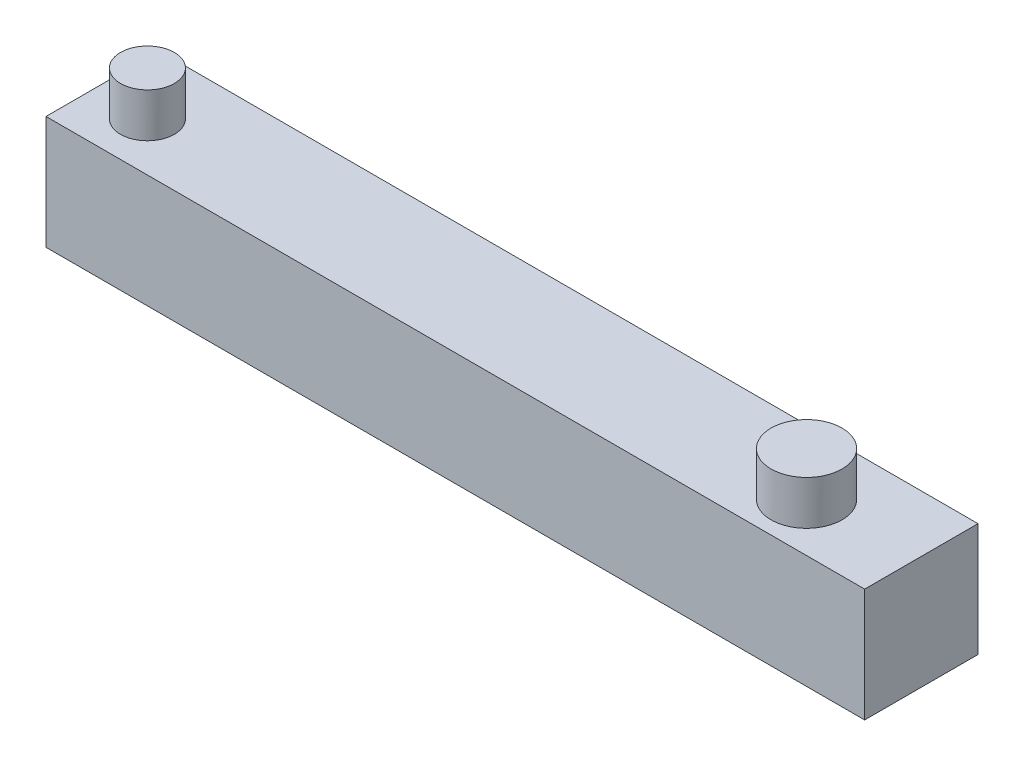
ISO-10303-21;
HEADER;
FILE_DESCRIPTION(('STEP AP214'),'2;1');
FILE_NAME('part.step','',(''),(''),'','','');
FILE_SCHEMA(('AUTOMOTIVE_DESIGN { 1 0 10303 214 1 1 1 1 }'));
ENDSEC;
DATA;
#1=APPLICATION_CONTEXT('core data for automotive mechanical design processes');
#2=APPLICATION_PROTOCOL_DEFINITION('international standard','automotive_design',2000,#1);
#3=PRODUCT_CONTEXT('',#1,'mechanical');
#4=PRODUCT('Part','Part','',(#3));
#5=PRODUCT_RELATED_PRODUCT_CATEGORY('part','',(#4));
#6=PRODUCT_DEFINITION_FORMATION('','',#4);
#7=PRODUCT_DEFINITION_CONTEXT('part definition',#1,'design');
#8=PRODUCT_DEFINITION('design','',#6,#7);
#9=PRODUCT_DEFINITION_SHAPE('','',#8);
#10=(LENGTH_UNIT() NAMED_UNIT(*) SI_UNIT(.MILLI.,.METRE.));
#11=(NAMED_UNIT(*) PLANE_ANGLE_UNIT() SI_UNIT($,.RADIAN.));
#12=(NAMED_UNIT(*) SI_UNIT($,.STERADIAN.) SOLID_ANGLE_UNIT());
#13=UNCERTAINTY_MEASURE_WITH_UNIT(LENGTH_MEASURE(1.E-05),#10,'distance_accuracy_value','');
#14=(GEOMETRIC_REPRESENTATION_CONTEXT(3) GLOBAL_UNCERTAINTY_ASSIGNED_CONTEXT((#13)) GLOBAL_UNIT_ASSIGNED_CONTEXT((#10,
#11,#12)) REPRESENTATION_CONTEXT('',''));
#15=CARTESIAN_POINT('',(0.,0.,0.));
#16=DIRECTION('',(0.,0.,1.));
#17=DIRECTION('',(1.,0.,0.));
#18=AXIS2_PLACEMENT_3D('',#15,#16,#17);
#19=CARTESIAN_POINT('',(0.,0.,9.));
#20=DIRECTION('',(1.,0.,0.));
#21=DIRECTION('',(0.,0.,-1.));
#22=AXIS2_PLACEMENT_3D('',#19,#20,#21);
#23=PLANE('',#22);
#24=DIRECTION('',(0.,-1.,0.));
#25=VECTOR('',#24,1.);
#26=CARTESIAN_POINT('',(0.,0.,0.));
#27=LINE('',#26,#25);
#28=CARTESIAN_POINT('',(0.,9.,0.));
#29=VERTEX_POINT('',#28);
#30=CARTESIAN_POINT('',(0.,0.,0.));
#31=VERTEX_POINT('',#30);
#32=EDGE_CURVE('E100',#29,#31,#27,.T.);
#33=ORIENTED_EDGE('',*,*,#32,.T.);
#34=DIRECTION('',(0.,0.,-1.));
#35=VECTOR('',#34,1.);
#36=CARTESIAN_POINT('',(0.,0.,9.));
#37=LINE('',#36,#35);
#38=CARTESIAN_POINT('',(0.,0.,9.));
#39=VERTEX_POINT('',#38);
#40=EDGE_CURVE('E91',#39,#31,#37,.T.);
#41=ORIENTED_EDGE('',*,*,#40,.F.);
#42=DIRECTION('',(0.,-1.,0.));
#43=VECTOR('',#42,1.);
#44=CARTESIAN_POINT('',(0.,0.,9.));
#45=LINE('',#44,#43);
#46=CARTESIAN_POINT('',(0.,9.,9.));
#47=VERTEX_POINT('',#46);
#48=EDGE_CURVE('E85',#47,#39,#45,.T.);
#49=ORIENTED_EDGE('',*,*,#48,.F.);
#50=DIRECTION('',(0.,0.,-1.));
#51=VECTOR('',#50,1.);
#52=CARTESIAN_POINT('',(0.,9.,9.));
#53=LINE('',#52,#51);
#54=EDGE_CURVE('E96',#47,#29,#53,.T.);
#55=ORIENTED_EDGE('',*,*,#54,.T.);
#56=EDGE_LOOP('',(#33,#41,#49,#55));
#57=FACE_BOUND('',#56,.T.);
#58=ADVANCED_FACE('F33',(#57),#23,.F.);
#59=CARTESIAN_POINT('',(0.,0.,9.));
#60=DIRECTION('',(0.,1.,0.));
#61=DIRECTION('',(0.,0.,1.));
#62=AXIS2_PLACEMENT_3D('',#59,#60,#61);
#63=PLANE('',#62);
#64=DIRECTION('',(1.,0.,0.));
#65=VECTOR('',#64,1.);
#66=CARTESIAN_POINT('',(0.,0.,0.));
#67=LINE('',#66,#65);
#68=CARTESIAN_POINT('',(65.,0.,0.));
#69=VERTEX_POINT('',#68);
#70=EDGE_CURVE('E90',#31,#69,#67,.T.);
#71=ORIENTED_EDGE('',*,*,#70,.T.);
#72=DIRECTION('',(0.,0.,-1.));
#73=VECTOR('',#72,1.);
#74=CARTESIAN_POINT('',(65.,0.,9.));
#75=LINE('',#74,#73);
#76=CARTESIAN_POINT('',(65.,0.,9.));
#77=VERTEX_POINT('',#76);
#78=EDGE_CURVE('E88',#77,#69,#75,.T.);
#79=ORIENTED_EDGE('',*,*,#78,.F.);
#80=DIRECTION('',(1.,0.,0.));
#81=VECTOR('',#80,1.);
#82=CARTESIAN_POINT('',(0.,0.,9.));
#83=LINE('',#82,#81);
#84=EDGE_CURVE('E80',#39,#77,#83,.T.);
#85=ORIENTED_EDGE('',*,*,#84,.F.);
#86=ORIENTED_EDGE('',*,*,#40,.T.);
#87=EDGE_LOOP('',(#71,#79,#85,#86));
#88=FACE_BOUND('',#87,.T.);
#89=ADVANCED_FACE('F89',(#88),#63,.F.);
#90=CARTESIAN_POINT('',(65.,0.,9.));
#91=DIRECTION('',(-1.,0.,0.));
#92=DIRECTION('',(0.,0.,1.));
#93=AXIS2_PLACEMENT_3D('',#90,#91,#92);
#94=PLANE('',#93);
#95=DIRECTION('',(0.,1.,0.));
#96=VECTOR('',#95,1.);
#97=CARTESIAN_POINT('',(65.,0.,0.));
#98=LINE('',#97,#96);
#99=CARTESIAN_POINT('',(65.,9.,0.));
#100=VERTEX_POINT('',#99);
#101=EDGE_CURVE('E66',#69,#100,#98,.T.);
#102=ORIENTED_EDGE('',*,*,#101,.T.);
#103=DIRECTION('',(0.,0.,-1.));
#104=VECTOR('',#103,1.);
#105=CARTESIAN_POINT('',(65.,9.,9.));
#106=LINE('',#105,#104);
#107=CARTESIAN_POINT('',(65.,9.,9.));
#108=VERTEX_POINT('',#107);
#109=EDGE_CURVE('E92',#108,#100,#106,.T.);
#110=ORIENTED_EDGE('',*,*,#109,.F.);
#111=DIRECTION('',(0.,1.,0.));
#112=VECTOR('',#111,1.);
#113=CARTESIAN_POINT('',(65.,0.,9.));
#114=LINE('',#113,#112);
#115=EDGE_CURVE('E83',#77,#108,#114,.T.);
#116=ORIENTED_EDGE('',*,*,#115,.F.);
#117=ORIENTED_EDGE('',*,*,#78,.T.);
#118=EDGE_LOOP('',(#102,#110,#116,#117));
#119=FACE_BOUND('',#118,.T.);
#120=ADVANCED_FACE('F94',(#119),#94,.F.);
#121=CARTESIAN_POINT('',(0.,9.,9.));
#122=DIRECTION('',(0.,-1.,0.));
#123=DIRECTION('',(0.,0.,-1.));
#124=AXIS2_PLACEMENT_3D('',#121,#122,#123);
#125=PLANE('',#124);
#126=CARTESIAN_POINT('',(56.5268480158352,9.,5.13809564608891));
#127=DIRECTION('',(0.,-1.,0.));
#128=DIRECTION('',(0.,0.,-1.));
#129=AXIS2_PLACEMENT_3D('',#126,#127,#128);
#130=CIRCLE('',#129,2.81652217103101);
#131=CARTESIAN_POINT('',(56.5268480158352,9.,2.3215734750579));
#132=VERTEX_POINT('',#131);
#133=EDGE_CURVE('E11',#132,#132,#130,.F.);
#134=ORIENTED_EDGE('',*,*,#133,.F.);
#135=EDGE_LOOP('',(#134));
#136=FACE_BOUND('',#135,.T.);
#137=CARTESIAN_POINT('',(4.19088053274663,9.,5.13809564608891));
#138=DIRECTION('',(0.,-1.,0.));
#139=DIRECTION('',(0.,0.,-1.));
#140=AXIS2_PLACEMENT_3D('',#137,#138,#139);
#141=CIRCLE('',#140,2.13580153575776);
#142=CARTESIAN_POINT('',(4.19088053274663,9.,3.00229411033115));
#143=VERTEX_POINT('',#142);
#144=EDGE_CURVE('E41',#143,#143,#141,.F.);
#145=ORIENTED_EDGE('',*,*,#144,.F.);
#146=EDGE_LOOP('',(#145));
#147=FACE_BOUND('',#146,.T.);
#148=DIRECTION('',(-1.,0.,0.));
#149=VECTOR('',#148,1.);
#150=CARTESIAN_POINT('',(0.,9.,0.));
#151=LINE('',#150,#149);
#152=EDGE_CURVE('E72',#100,#29,#151,.T.);
#153=ORIENTED_EDGE('',*,*,#152,.T.);
#154=ORIENTED_EDGE('',*,*,#54,.F.);
#155=DIRECTION('',(-1.,0.,0.));
#156=VECTOR('',#155,1.);
#157=CARTESIAN_POINT('',(0.,9.,9.));
#158=LINE('',#157,#156);
#159=EDGE_CURVE('E49',#108,#47,#158,.T.);
#160=ORIENTED_EDGE('',*,*,#159,.F.);
#161=ORIENTED_EDGE('',*,*,#109,.T.);
#162=EDGE_LOOP('',(#153,#154,#160,#161));
#163=FACE_BOUND('',#162,.T.);
#164=ADVANCED_FACE('F114',(#136,#147,#163),#125,.F.);
#165=CARTESIAN_POINT('',(0.,0.,9.));
#166=DIRECTION('',(0.,0.,-1.));
#167=DIRECTION('',(-1.,0.,0.));
#168=AXIS2_PLACEMENT_3D('',#165,#166,#167);
#169=PLANE('',#168);
#170=ORIENTED_EDGE('',*,*,#48,.T.);
#171=ORIENTED_EDGE('',*,*,#84,.T.);
#172=ORIENTED_EDGE('',*,*,#115,.T.);
#173=ORIENTED_EDGE('',*,*,#159,.T.);
#174=EDGE_LOOP('',(#170,#171,#172,#173));
#175=FACE_BOUND('',#174,.T.);
#176=ADVANCED_FACE('F81',(#175),#169,.F.);
#177=CARTESIAN_POINT('',(0.,0.,0.));
#178=DIRECTION('',(0.,0.,-1.));
#179=DIRECTION('',(-1.,0.,0.));
#180=AXIS2_PLACEMENT_3D('',#177,#178,#179);
#181=PLANE('',#180);
#182=ORIENTED_EDGE('',*,*,#32,.F.);
#183=ORIENTED_EDGE('',*,*,#152,.F.);
#184=ORIENTED_EDGE('',*,*,#101,.F.);
#185=ORIENTED_EDGE('',*,*,#70,.F.);
#186=EDGE_LOOP('',(#182,#183,#184,#185));
#187=FACE_BOUND('',#186,.T.);
#188=ADVANCED_FACE('F122',(#187),#181,.T.);
#189=CARTESIAN_POINT('',(4.19088053274663,12.5,5.13809564608891));
#190=DIRECTION('',(0.,-1.,0.));
#191=DIRECTION('',(0.,0.,-1.));
#192=AXIS2_PLACEMENT_3D('',#189,#190,#191);
#193=CYLINDRICAL_SURFACE('',#192,2.13580153575776);
#194=CARTESIAN_POINT('',(4.19088053274663,12.5,5.13809564608891));
#195=DIRECTION('',(0.,1.,0.));
#196=DIRECTION('',(0.,0.,1.));
#197=AXIS2_PLACEMENT_3D('',#194,#195,#196);
#198=CIRCLE('',#197,2.13580153575776);
#199=CARTESIAN_POINT('',(4.19088053274663,12.5,7.27389718184668));
#200=VERTEX_POINT('',#199);
#201=EDGE_CURVE('E103',#200,#200,#198,.T.);
#202=ORIENTED_EDGE('',*,*,#201,.F.);
#203=EDGE_LOOP('',(#202));
#204=FACE_BOUND('',#203,.T.);
#205=ORIENTED_EDGE('',*,*,#144,.T.);
#206=EDGE_LOOP('',(#205));
#207=FACE_BOUND('',#206,.T.);
#208=ADVANCED_FACE('F112',(#204,#207),#193,.T.);
#209=CARTESIAN_POINT('',(4.19088053274663,12.5,5.13809564608891));
#210=DIRECTION('',(0.,1.,0.));
#211=DIRECTION('',(0.,0.,1.));
#212=AXIS2_PLACEMENT_3D('',#209,#210,#211);
#213=PLANE('',#212);
#214=ORIENTED_EDGE('',*,*,#201,.T.);
#215=EDGE_LOOP('',(#214));
#216=FACE_BOUND('',#215,.T.);
#217=ADVANCED_FACE('F138',(#216),#213,.T.);
#218=CARTESIAN_POINT('',(56.5268480158352,12.5,5.13809564608891));
#219=DIRECTION('',(0.,-1.,0.));
#220=DIRECTION('',(0.,0.,-1.));
#221=AXIS2_PLACEMENT_3D('',#218,#219,#220);
#222=CYLINDRICAL_SURFACE('',#221,2.81652217103101);
#223=CARTESIAN_POINT('',(56.5268480158352,12.5,5.13809564608891));
#224=DIRECTION('',(0.,1.,0.));
#225=DIRECTION('',(0.,0.,1.));
#226=AXIS2_PLACEMENT_3D('',#223,#224,#225);
#227=CIRCLE('',#226,2.81652217103101);
#228=CARTESIAN_POINT('',(56.5268480158352,12.5,7.95461781711993));
#229=VERTEX_POINT('',#228);
#230=EDGE_CURVE('E156',#229,#229,#227,.T.);
#231=ORIENTED_EDGE('',*,*,#230,.F.);
#232=EDGE_LOOP('',(#231));
#233=FACE_BOUND('',#232,.T.);
#234=ORIENTED_EDGE('',*,*,#133,.T.);
#235=EDGE_LOOP('',(#234));
#236=FACE_BOUND('',#235,.T.);
#237=ADVANCED_FACE('F144',(#233,#236),#222,.T.);
#238=CARTESIAN_POINT('',(56.5268480158352,12.5,5.13809564608891));
#239=DIRECTION('',(0.,1.,0.));
#240=DIRECTION('',(0.,0.,1.));
#241=AXIS2_PLACEMENT_3D('',#238,#239,#240);
#242=PLANE('',#241);
#243=ORIENTED_EDGE('',*,*,#230,.T.);
#244=EDGE_LOOP('',(#243));
#245=FACE_BOUND('',#244,.T.);
#246=ADVANCED_FACE('F148',(#245),#242,.T.);
#247=CLOSED_SHELL('',(#58,#89,#120,#164,#176,#188,#208,#217,#237,#246));
#248=MANIFOLD_SOLID_BREP('B2',#247);
#249=ADVANCED_BREP_SHAPE_REPRESENTATION('',(#18,#248),#14);
#250=SHAPE_DEFINITION_REPRESENTATION(#9,#249);
ENDSEC;
END-ISO-10303-21;
